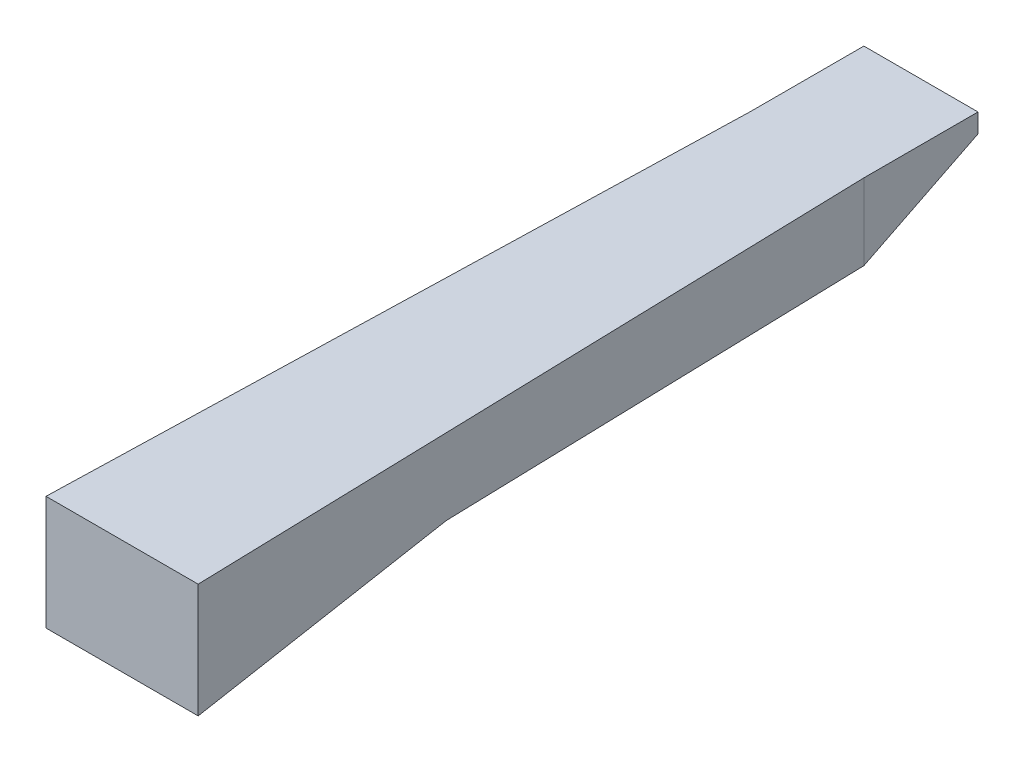
ISO-10303-21;
HEADER;
FILE_DESCRIPTION(('STEP AP214'),'2;1');
FILE_NAME('part.step','',(''),(''),'','','');
FILE_SCHEMA(('AUTOMOTIVE_DESIGN { 1 0 10303 214 1 1 1 1 }'));
ENDSEC;
DATA;
#1=APPLICATION_CONTEXT('core data for automotive mechanical design processes');
#2=APPLICATION_PROTOCOL_DEFINITION('international standard','automotive_design',2000,#1);
#3=PRODUCT_CONTEXT('',#1,'mechanical');
#4=PRODUCT('Part','Part','',(#3));
#5=PRODUCT_RELATED_PRODUCT_CATEGORY('part','',(#4));
#6=PRODUCT_DEFINITION_FORMATION('','',#4);
#7=PRODUCT_DEFINITION_CONTEXT('part definition',#1,'design');
#8=PRODUCT_DEFINITION('design','',#6,#7);
#9=PRODUCT_DEFINITION_SHAPE('','',#8);
#10=(LENGTH_UNIT() NAMED_UNIT(*) SI_UNIT(.MILLI.,.METRE.));
#11=(NAMED_UNIT(*) PLANE_ANGLE_UNIT() SI_UNIT($,.RADIAN.));
#12=(NAMED_UNIT(*) SI_UNIT($,.STERADIAN.) SOLID_ANGLE_UNIT());
#13=UNCERTAINTY_MEASURE_WITH_UNIT(LENGTH_MEASURE(1.E-05),#10,'distance_accuracy_value','');
#14=(GEOMETRIC_REPRESENTATION_CONTEXT(3) GLOBAL_UNCERTAINTY_ASSIGNED_CONTEXT((#13)) GLOBAL_UNIT_ASSIGNED_CONTEXT((#10,
#11,#12)) REPRESENTATION_CONTEXT('',''));
#15=CARTESIAN_POINT('',(0.,0.,0.));
#16=DIRECTION('',(0.,0.,1.));
#17=DIRECTION('',(1.,0.,0.));
#18=AXIS2_PLACEMENT_3D('',#15,#16,#17);
#19=CARTESIAN_POINT('',(-22.2078643022359,50.8,-0.616885119506556));
#20=DIRECTION('',(0.999614420652718,0.,0.0277670672403534));
#21=DIRECTION('',(0.0277670672403534,0.,-0.999614420652718));
#22=AXIS2_PLACEMENT_3D('',#19,#20,#21);
#23=PLANE('',#22);
#24=DIRECTION('',(0.,-1.,0.));
#25=VECTOR('',#24,1.);
#26=CARTESIAN_POINT('',(-25.4,50.8,114.3));
#27=LINE('',#26,#25);
#28=CARTESIAN_POINT('',(-25.4000000000001,38.1,114.3));
#29=VERTEX_POINT('',#28);
#30=CARTESIAN_POINT('',(-25.4000000000001,0.,114.3));
#31=VERTEX_POINT('',#30);
#32=EDGE_CURVE('E119',#29,#31,#27,.T.);
#33=ORIENTED_EDGE('',*,*,#32,.F.);
#34=DIRECTION('',(0.0277670672403534,0.,-0.999614420652718));
#35=VECTOR('',#34,1.);
#36=CARTESIAN_POINT('',(-22.2078643022359,38.1,-0.616885119506556));
#37=LINE('',#36,#35);
#38=CARTESIAN_POINT('',(-19.05,38.1,-114.3));
#39=VERTEX_POINT('',#38);
#40=EDGE_CURVE('E101',#29,#39,#37,.T.);
#41=ORIENTED_EDGE('',*,*,#40,.T.);
#42=DIRECTION('',(0.,-1.,0.));
#43=VECTOR('',#42,1.);
#44=CARTESIAN_POINT('',(-19.05,50.8,-114.3));
#45=LINE('',#44,#43);
#46=CARTESIAN_POINT('',(-19.05,12.7,-114.3));
#47=VERTEX_POINT('',#46);
#48=EDGE_CURVE('E143',#39,#47,#45,.T.);
#49=ORIENTED_EDGE('',*,*,#48,.T.);
#50=DIRECTION('',(0.0277670672403534,0.,-0.999614420652718));
#51=VECTOR('',#50,1.);
#52=CARTESIAN_POINT('',(-22.2078643022359,12.7,-0.616885119506565));
#53=LINE('',#52,#51);
#54=CARTESIAN_POINT('',(-23.0327135389804,12.7,29.0776874032952));
#55=VERTEX_POINT('',#54);
#56=EDGE_CURVE('E195',#55,#47,#53,.T.);
#57=ORIENTED_EDGE('',*,*,#56,.F.);
#58=DIRECTION('',(0.0274640199145106,0.147338760499673,-0.988704716922376));
#59=VECTOR('',#58,1.);
#60=CARTESIAN_POINT('',(-22.0715985071333,17.8561824500111,-5.52245374320026));
#61=LINE('',#60,#59);
#62=EDGE_CURVE('E126',#31,#55,#61,.T.);
#63=ORIENTED_EDGE('',*,*,#62,.F.);
#64=EDGE_LOOP('',(#33,#41,#49,#57,#63));
#65=FACE_BOUND('',#64,.T.);
#66=ADVANCED_FACE('F44',(#65),#23,.F.);
#67=CARTESIAN_POINT('',(22.2078643022359,50.8,-0.61688511950655));
#68=DIRECTION('',(-0.999614420652718,0.,0.0277670672403531));
#69=DIRECTION('',(0.0277670672403531,0.,0.999614420652718));
#70=AXIS2_PLACEMENT_3D('',#67,#68,#69);
#71=PLANE('',#70);
#72=DIRECTION('',(0.,-1.,0.));
#73=VECTOR('',#72,1.);
#74=CARTESIAN_POINT('',(19.05,50.8,-114.3));
#75=LINE('',#74,#73);
#76=CARTESIAN_POINT('',(19.05,38.1,-114.3));
#77=VERTEX_POINT('',#76);
#78=CARTESIAN_POINT('',(19.05,12.7,-114.3));
#79=VERTEX_POINT('',#78);
#80=EDGE_CURVE('E133',#77,#79,#75,.T.);
#81=ORIENTED_EDGE('',*,*,#80,.F.);
#82=DIRECTION('',(0.0277670672403531,0.,0.999614420652718));
#83=VECTOR('',#82,1.);
#84=CARTESIAN_POINT('',(22.2078643022359,38.1,-0.61688511950655));
#85=LINE('',#84,#83);
#86=CARTESIAN_POINT('',(25.4,38.1,114.3));
#87=VERTEX_POINT('',#86);
#88=EDGE_CURVE('E169',#77,#87,#85,.T.);
#89=ORIENTED_EDGE('',*,*,#88,.T.);
#90=DIRECTION('',(0.,-1.,0.));
#91=VECTOR('',#90,1.);
#92=CARTESIAN_POINT('',(25.4,50.8,114.3));
#93=LINE('',#92,#91);
#94=CARTESIAN_POINT('',(25.4,0.,114.3));
#95=VERTEX_POINT('',#94);
#96=EDGE_CURVE('E120',#87,#95,#93,.T.);
#97=ORIENTED_EDGE('',*,*,#96,.T.);
#98=DIRECTION('',(0.0274640199145103,-0.147338760499673,0.988704716922376));
#99=VECTOR('',#98,1.);
#100=CARTESIAN_POINT('',(22.0715985071333,17.8561824500111,-5.52245374320026));
#101=LINE('',#100,#99);
#102=CARTESIAN_POINT('',(23.0327135389804,12.7,29.0776874032952));
#103=VERTEX_POINT('',#102);
#104=EDGE_CURVE('E67',#103,#95,#101,.T.);
#105=ORIENTED_EDGE('',*,*,#104,.F.);
#106=DIRECTION('',(0.0277670672403531,0.,0.999614420652718));
#107=VECTOR('',#106,1.);
#108=CARTESIAN_POINT('',(22.2078643022359,12.7,-0.616885119506559));
#109=LINE('',#108,#107);
#110=EDGE_CURVE('E11',#79,#103,#109,.T.);
#111=ORIENTED_EDGE('',*,*,#110,.F.);
#112=EDGE_LOOP('',(#81,#89,#97,#105,#111));
#113=FACE_BOUND('',#112,.T.);
#114=ADVANCED_FACE('F168',(#113),#71,.F.);
#115=CARTESIAN_POINT('',(19.05,50.8,0.));
#116=DIRECTION('',(1.,0.,0.));
#117=DIRECTION('',(0.,0.,-1.));
#118=AXIS2_PLACEMENT_3D('',#115,#116,#117);
#119=PLANE('',#118);
#120=DIRECTION('',(0.,0.,-1.));
#121=VECTOR('',#120,1.);
#122=CARTESIAN_POINT('',(19.05,38.1,0.));
#123=LINE('',#122,#121);
#124=CARTESIAN_POINT('',(19.05,38.1,-152.4));
#125=VERTEX_POINT('',#124);
#126=EDGE_CURVE('E111',#77,#125,#123,.T.);
#127=ORIENTED_EDGE('',*,*,#126,.F.);
#128=ORIENTED_EDGE('',*,*,#80,.T.);
#129=DIRECTION('',(0.,0.447213595499956,-0.894427190999917));
#130=VECTOR('',#129,1.);
#131=CARTESIAN_POINT('',(19.05,-25.3999999999999,-38.0999999999998));
#132=LINE('',#131,#130);
#133=CARTESIAN_POINT('',(19.05,31.75,-152.4));
#134=VERTEX_POINT('',#133);
#135=EDGE_CURVE('E112',#79,#134,#132,.T.);
#136=ORIENTED_EDGE('',*,*,#135,.T.);
#137=DIRECTION('',(0.,-1.,0.));
#138=VECTOR('',#137,1.);
#139=CARTESIAN_POINT('',(19.05,50.8,-152.4));
#140=LINE('',#139,#138);
#141=EDGE_CURVE('E151',#125,#134,#140,.T.);
#142=ORIENTED_EDGE('',*,*,#141,.F.);
#143=EDGE_LOOP('',(#127,#128,#136,#142));
#144=FACE_BOUND('',#143,.T.);
#145=ADVANCED_FACE('F165',(#144),#119,.T.);
#146=CARTESIAN_POINT('',(1.11022302462516E-13,50.8,-152.4));
#147=DIRECTION('',(0.,0.,-1.));
#148=DIRECTION('',(-1.,0.,0.));
#149=AXIS2_PLACEMENT_3D('',#146,#147,#148);
#150=PLANE('',#149);
#151=DIRECTION('',(1.,0.,0.));
#152=VECTOR('',#151,1.);
#153=CARTESIAN_POINT('',(-25.4,38.1,-152.4));
#154=LINE('',#153,#152);
#155=CARTESIAN_POINT('',(-19.05,38.1,-152.4));
#156=VERTEX_POINT('',#155);
#157=EDGE_CURVE('E59',#156,#125,#154,.T.);
#158=ORIENTED_EDGE('',*,*,#157,.T.);
#159=ORIENTED_EDGE('',*,*,#141,.T.);
#160=DIRECTION('',(1.,0.,0.));
#161=VECTOR('',#160,1.);
#162=CARTESIAN_POINT('',(-25.4,31.75,-152.4));
#163=LINE('',#162,#161);
#164=CARTESIAN_POINT('',(-19.05,31.75,-152.4));
#165=VERTEX_POINT('',#164);
#166=EDGE_CURVE('E149',#165,#134,#163,.T.);
#167=ORIENTED_EDGE('',*,*,#166,.F.);
#168=DIRECTION('',(0.,-1.,0.));
#169=VECTOR('',#168,1.);
#170=CARTESIAN_POINT('',(-19.05,50.8,-152.4));
#171=LINE('',#170,#169);
#172=EDGE_CURVE('E142',#156,#165,#171,.T.);
#173=ORIENTED_EDGE('',*,*,#172,.F.);
#174=EDGE_LOOP('',(#158,#159,#167,#173));
#175=FACE_BOUND('',#174,.T.);
#176=ADVANCED_FACE('F146',(#175),#150,.T.);
#177=CARTESIAN_POINT('',(-19.05,50.8,0.));
#178=DIRECTION('',(1.,0.,0.));
#179=DIRECTION('',(0.,0.,-1.));
#180=AXIS2_PLACEMENT_3D('',#177,#178,#179);
#181=PLANE('',#180);
#182=ORIENTED_EDGE('',*,*,#48,.F.);
#183=DIRECTION('',(0.,0.,-1.));
#184=VECTOR('',#183,1.);
#185=CARTESIAN_POINT('',(-19.05,38.1,0.));
#186=LINE('',#185,#184);
#187=EDGE_CURVE('E52',#39,#156,#186,.T.);
#188=ORIENTED_EDGE('',*,*,#187,.T.);
#189=ORIENTED_EDGE('',*,*,#172,.T.);
#190=DIRECTION('',(0.,0.447213595499956,-0.894427190999917));
#191=VECTOR('',#190,1.);
#192=CARTESIAN_POINT('',(-19.05,-25.3999999999999,-38.0999999999998));
#193=LINE('',#192,#191);
#194=EDGE_CURVE('E128',#47,#165,#193,.T.);
#195=ORIENTED_EDGE('',*,*,#194,.F.);
#196=EDGE_LOOP('',(#182,#188,#189,#195));
#197=FACE_BOUND('',#196,.T.);
#198=ADVANCED_FACE('F140',(#197),#181,.F.);
#199=CARTESIAN_POINT('',(0.,50.8,114.3));
#200=DIRECTION('',(0.,0.,-1.));
#201=DIRECTION('',(-1.,0.,0.));
#202=AXIS2_PLACEMENT_3D('',#199,#200,#201);
#203=PLANE('',#202);
#204=ORIENTED_EDGE('',*,*,#96,.F.);
#205=DIRECTION('',(1.,0.,0.));
#206=VECTOR('',#205,1.);
#207=CARTESIAN_POINT('',(-25.4000000000001,38.1,114.3));
#208=LINE('',#207,#206);
#209=EDGE_CURVE('E104',#29,#87,#208,.T.);
#210=ORIENTED_EDGE('',*,*,#209,.F.);
#211=ORIENTED_EDGE('',*,*,#32,.T.);
#212=DIRECTION('',(1.,0.,0.));
#213=VECTOR('',#212,1.);
#214=CARTESIAN_POINT('',(0.,0.,114.3));
#215=LINE('',#214,#213);
#216=EDGE_CURVE('E156',#31,#95,#215,.T.);
#217=ORIENTED_EDGE('',*,*,#216,.T.);
#218=EDGE_LOOP('',(#204,#210,#211,#217));
#219=FACE_BOUND('',#218,.T.);
#220=ADVANCED_FACE('F117',(#219),#203,.F.);
#221=CARTESIAN_POINT('',(-25.4,12.7,0.));
#222=DIRECTION('',(0.,-1.,0.));
#223=DIRECTION('',(0.,0.,-1.));
#224=AXIS2_PLACEMENT_3D('',#221,#222,#223);
#225=PLANE('',#224);
#226=ORIENTED_EDGE('',*,*,#56,.T.);
#227=DIRECTION('',(1.,0.,0.));
#228=VECTOR('',#227,1.);
#229=CARTESIAN_POINT('',(-25.4,12.7,-114.3));
#230=LINE('',#229,#228);
#231=EDGE_CURVE('E175',#47,#79,#230,.T.);
#232=ORIENTED_EDGE('',*,*,#231,.T.);
#233=ORIENTED_EDGE('',*,*,#110,.T.);
#234=DIRECTION('',(1.,0.,0.));
#235=VECTOR('',#234,1.);
#236=CARTESIAN_POINT('',(-25.4,12.7,29.0776874032952));
#237=LINE('',#236,#235);
#238=EDGE_CURVE('E122',#55,#103,#237,.T.);
#239=ORIENTED_EDGE('',*,*,#238,.F.);
#240=EDGE_LOOP('',(#226,#232,#233,#239));
#241=FACE_BOUND('',#240,.T.);
#242=ADVANCED_FACE('F173',(#241),#225,.T.);
#243=CARTESIAN_POINT('',(-25.4,-35.5599999999998,-17.7799999999998));
#244=DIRECTION('',(0.,-0.894427190999917,-0.447213595499956));
#245=DIRECTION('',(0.,0.447213595499956,-0.894427190999917));
#246=AXIS2_PLACEMENT_3D('',#243,#244,#245);
#247=PLANE('',#246);
#248=ORIENTED_EDGE('',*,*,#231,.F.);
#249=ORIENTED_EDGE('',*,*,#194,.T.);
#250=ORIENTED_EDGE('',*,*,#166,.T.);
#251=ORIENTED_EDGE('',*,*,#135,.F.);
#252=EDGE_LOOP('',(#248,#249,#250,#251));
#253=FACE_BOUND('',#252,.T.);
#254=ADVANCED_FACE('F200',(#253),#247,.T.);
#255=CARTESIAN_POINT('',(-25.4,16.6631670591215,2.48317858554598));
#256=DIRECTION('',(0.,-0.989077804327646,-0.147394358733311));
#257=DIRECTION('',(0.,0.147394358733311,-0.989077804327645));
#258=AXIS2_PLACEMENT_3D('',#255,#256,#257);
#259=PLANE('',#258);
#260=ORIENTED_EDGE('',*,*,#62,.T.);
#261=ORIENTED_EDGE('',*,*,#238,.T.);
#262=ORIENTED_EDGE('',*,*,#104,.T.);
#263=ORIENTED_EDGE('',*,*,#216,.F.);
#264=EDGE_LOOP('',(#260,#261,#262,#263));
#265=FACE_BOUND('',#264,.T.);
#266=ADVANCED_FACE('F176',(#265),#259,.T.);
#267=CARTESIAN_POINT('',(-25.4,38.1,0.));
#268=DIRECTION('',(0.,-1.,0.));
#269=DIRECTION('',(0.,0.,-1.));
#270=AXIS2_PLACEMENT_3D('',#267,#268,#269);
#271=PLANE('',#270);
#272=ORIENTED_EDGE('',*,*,#126,.T.);
#273=ORIENTED_EDGE('',*,*,#157,.F.);
#274=ORIENTED_EDGE('',*,*,#187,.F.);
#275=ORIENTED_EDGE('',*,*,#40,.F.);
#276=ORIENTED_EDGE('',*,*,#209,.T.);
#277=ORIENTED_EDGE('',*,*,#88,.F.);
#278=EDGE_LOOP('',(#272,#273,#274,#275,#276,#277));
#279=FACE_BOUND('',#278,.T.);
#280=ADVANCED_FACE('F103',(#279),#271,.F.);
#281=CLOSED_SHELL('',(#66,#114,#145,#176,#198,#220,#242,#254,#266,#280));
#282=MANIFOLD_SOLID_BREP('B2',#281);
#283=ADVANCED_BREP_SHAPE_REPRESENTATION('',(#18,#282),#14);
#284=SHAPE_DEFINITION_REPRESENTATION(#9,#283);
ENDSEC;
END-ISO-10303-21;
